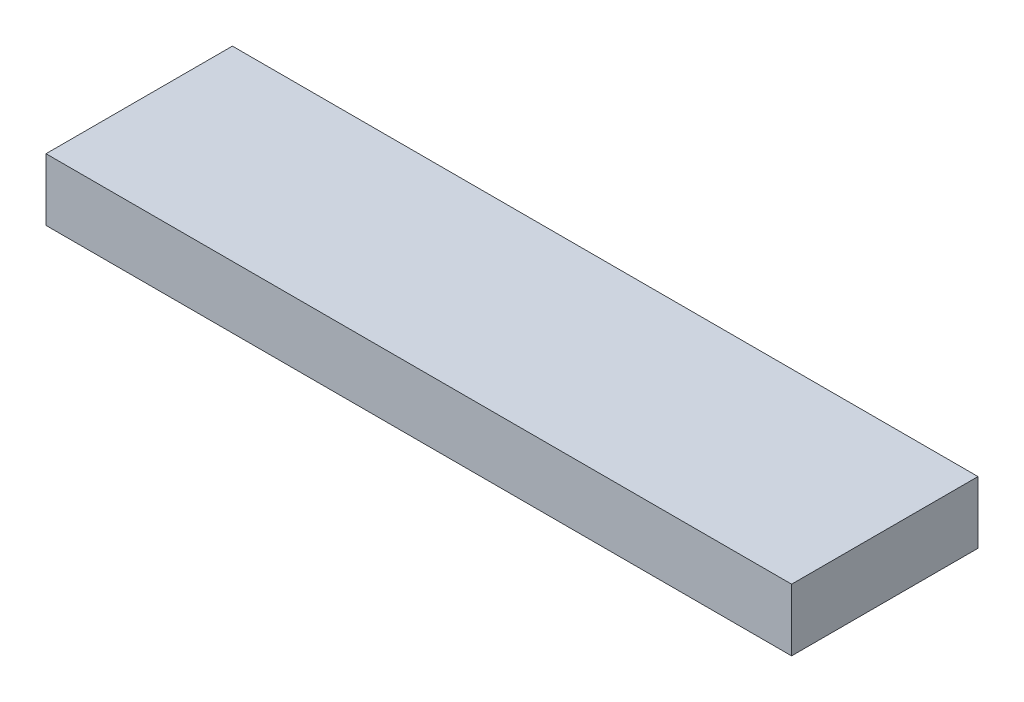
ISO-10303-21;
HEADER;
FILE_DESCRIPTION(('STEP AP214'),'2;1');
FILE_NAME('part.step','',(''),(''),'','','');
FILE_SCHEMA(('AUTOMOTIVE_DESIGN { 1 0 10303 214 1 1 1 1 }'));
ENDSEC;
DATA;
#1=APPLICATION_CONTEXT('core data for automotive mechanical design processes');
#2=APPLICATION_PROTOCOL_DEFINITION('international standard','automotive_design',2000,#1);
#3=PRODUCT_CONTEXT('',#1,'mechanical');
#4=PRODUCT('Part','Part','',(#3));
#5=PRODUCT_RELATED_PRODUCT_CATEGORY('part','',(#4));
#6=PRODUCT_DEFINITION_FORMATION('','',#4);
#7=PRODUCT_DEFINITION_CONTEXT('part definition',#1,'design');
#8=PRODUCT_DEFINITION('design','',#6,#7);
#9=PRODUCT_DEFINITION_SHAPE('','',#8);
#10=(LENGTH_UNIT() NAMED_UNIT(*) SI_UNIT(.MILLI.,.METRE.));
#11=(NAMED_UNIT(*) PLANE_ANGLE_UNIT() SI_UNIT($,.RADIAN.));
#12=(NAMED_UNIT(*) SI_UNIT($,.STERADIAN.) SOLID_ANGLE_UNIT());
#13=UNCERTAINTY_MEASURE_WITH_UNIT(LENGTH_MEASURE(1.E-05),#10,'distance_accuracy_value','');
#14=(GEOMETRIC_REPRESENTATION_CONTEXT(3) GLOBAL_UNCERTAINTY_ASSIGNED_CONTEXT((#13)) GLOBAL_UNIT_ASSIGNED_CONTEXT((#10,
#11,#12)) REPRESENTATION_CONTEXT('',''));
#15=CARTESIAN_POINT('',(0.,0.,0.));
#16=DIRECTION('',(0.,0.,1.));
#17=DIRECTION('',(1.,0.,0.));
#18=AXIS2_PLACEMENT_3D('',#15,#16,#17);
#19=CARTESIAN_POINT('',(-38.1,6.35,-9.52499999999999));
#20=DIRECTION('',(1.,0.,0.));
#21=DIRECTION('',(0.,0.,-1.));
#22=AXIS2_PLACEMENT_3D('',#19,#20,#21);
#23=PLANE('',#22);
#24=DIRECTION('',(0.,0.,1.));
#25=VECTOR('',#24,1.);
#26=CARTESIAN_POINT('',(-38.1,0.,-9.52499999999999));
#27=LINE('',#26,#25);
#28=CARTESIAN_POINT('',(-38.1,0.,-9.52499999999999));
#29=VERTEX_POINT('',#28);
#30=CARTESIAN_POINT('',(-38.1,0.,9.52500000000001));
#31=VERTEX_POINT('',#30);
#32=EDGE_CURVE('E96',#29,#31,#27,.T.);
#33=ORIENTED_EDGE('',*,*,#32,.T.);
#34=DIRECTION('',(0.,-1.,0.));
#35=VECTOR('',#34,1.);
#36=CARTESIAN_POINT('',(-38.1,6.35,9.52500000000001));
#37=LINE('',#36,#35);
#38=CARTESIAN_POINT('',(-38.1,6.35,9.52500000000001));
#39=VERTEX_POINT('',#38);
#40=EDGE_CURVE('E11',#39,#31,#37,.T.);
#41=ORIENTED_EDGE('',*,*,#40,.F.);
#42=DIRECTION('',(0.,0.,1.));
#43=VECTOR('',#42,1.);
#44=CARTESIAN_POINT('',(-38.1,6.35,-9.52499999999999));
#45=LINE('',#44,#43);
#46=CARTESIAN_POINT('',(-38.1,6.35,-9.52499999999999));
#47=VERTEX_POINT('',#46);
#48=EDGE_CURVE('E84',#47,#39,#45,.T.);
#49=ORIENTED_EDGE('',*,*,#48,.F.);
#50=DIRECTION('',(0.,-1.,0.));
#51=VECTOR('',#50,1.);
#52=CARTESIAN_POINT('',(-38.1,6.35,-9.52499999999999));
#53=LINE('',#52,#51);
#54=EDGE_CURVE('E92',#47,#29,#53,.T.);
#55=ORIENTED_EDGE('',*,*,#54,.T.);
#56=EDGE_LOOP('',(#33,#41,#49,#55));
#57=FACE_BOUND('',#56,.T.);
#58=ADVANCED_FACE('F33',(#57),#23,.F.);
#59=CARTESIAN_POINT('',(38.1,6.35,9.525));
#60=DIRECTION('',(0.,0.,-1.));
#61=DIRECTION('',(-1.,0.,0.));
#62=AXIS2_PLACEMENT_3D('',#59,#60,#61);
#63=PLANE('',#62);
#64=DIRECTION('',(1.,0.,0.));
#65=VECTOR('',#64,1.);
#66=CARTESIAN_POINT('',(38.1,0.,9.525));
#67=LINE('',#66,#65);
#68=CARTESIAN_POINT('',(38.1,0.,9.525));
#69=VERTEX_POINT('',#68);
#70=EDGE_CURVE('E88',#31,#69,#67,.T.);
#71=ORIENTED_EDGE('',*,*,#70,.T.);
#72=DIRECTION('',(0.,-1.,0.));
#73=VECTOR('',#72,1.);
#74=CARTESIAN_POINT('',(38.1,6.35,9.525));
#75=LINE('',#74,#73);
#76=CARTESIAN_POINT('',(38.1,6.35,9.525));
#77=VERTEX_POINT('',#76);
#78=EDGE_CURVE('E41',#77,#69,#75,.T.);
#79=ORIENTED_EDGE('',*,*,#78,.F.);
#80=DIRECTION('',(1.,0.,0.));
#81=VECTOR('',#80,1.);
#82=CARTESIAN_POINT('',(38.1,6.35,9.525));
#83=LINE('',#82,#81);
#84=EDGE_CURVE('E79',#39,#77,#83,.T.);
#85=ORIENTED_EDGE('',*,*,#84,.F.);
#86=ORIENTED_EDGE('',*,*,#40,.T.);
#87=EDGE_LOOP('',(#71,#79,#85,#86));
#88=FACE_BOUND('',#87,.T.);
#89=ADVANCED_FACE('F87',(#88),#63,.F.);
#90=CARTESIAN_POINT('',(38.1,6.35,-9.525));
#91=DIRECTION('',(-1.,0.,0.));
#92=DIRECTION('',(0.,0.,1.));
#93=AXIS2_PLACEMENT_3D('',#90,#91,#92);
#94=PLANE('',#93);
#95=DIRECTION('',(0.,0.,-1.));
#96=VECTOR('',#95,1.);
#97=CARTESIAN_POINT('',(38.1,0.,-9.525));
#98=LINE('',#97,#96);
#99=CARTESIAN_POINT('',(38.1,0.,-9.525));
#100=VERTEX_POINT('',#99);
#101=EDGE_CURVE('E66',#69,#100,#98,.T.);
#102=ORIENTED_EDGE('',*,*,#101,.T.);
#103=DIRECTION('',(0.,-1.,0.));
#104=VECTOR('',#103,1.);
#105=CARTESIAN_POINT('',(38.1,6.35,-9.525));
#106=LINE('',#105,#104);
#107=CARTESIAN_POINT('',(38.1,6.35,-9.525));
#108=VERTEX_POINT('',#107);
#109=EDGE_CURVE('E89',#108,#100,#106,.T.);
#110=ORIENTED_EDGE('',*,*,#109,.F.);
#111=DIRECTION('',(0.,0.,-1.));
#112=VECTOR('',#111,1.);
#113=CARTESIAN_POINT('',(38.1,6.35,-9.525));
#114=LINE('',#113,#112);
#115=EDGE_CURVE('E82',#77,#108,#114,.T.);
#116=ORIENTED_EDGE('',*,*,#115,.F.);
#117=ORIENTED_EDGE('',*,*,#78,.T.);
#118=EDGE_LOOP('',(#102,#110,#116,#117));
#119=FACE_BOUND('',#118,.T.);
#120=ADVANCED_FACE('F90',(#119),#94,.F.);
#121=CARTESIAN_POINT('',(38.1,6.35,-9.525));
#122=DIRECTION('',(0.,0.,1.));
#123=DIRECTION('',(1.,0.,0.));
#124=AXIS2_PLACEMENT_3D('',#121,#122,#123);
#125=PLANE('',#124);
#126=DIRECTION('',(-1.,0.,0.));
#127=VECTOR('',#126,1.);
#128=CARTESIAN_POINT('',(38.1,0.,-9.525));
#129=LINE('',#128,#127);
#130=EDGE_CURVE('E72',#100,#29,#129,.T.);
#131=ORIENTED_EDGE('',*,*,#130,.T.);
#132=ORIENTED_EDGE('',*,*,#54,.F.);
#133=DIRECTION('',(-1.,0.,0.));
#134=VECTOR('',#133,1.);
#135=CARTESIAN_POINT('',(38.1,6.35,-9.525));
#136=LINE('',#135,#134);
#137=EDGE_CURVE('E49',#108,#47,#136,.T.);
#138=ORIENTED_EDGE('',*,*,#137,.F.);
#139=ORIENTED_EDGE('',*,*,#109,.T.);
#140=EDGE_LOOP('',(#131,#132,#138,#139));
#141=FACE_BOUND('',#140,.T.);
#142=ADVANCED_FACE('F103',(#141),#125,.F.);
#143=CARTESIAN_POINT('',(0.,6.35,0.));
#144=DIRECTION('',(0.,-1.,0.));
#145=DIRECTION('',(0.,0.,-1.));
#146=AXIS2_PLACEMENT_3D('',#143,#144,#145);
#147=PLANE('',#146);
#148=ORIENTED_EDGE('',*,*,#48,.T.);
#149=ORIENTED_EDGE('',*,*,#84,.T.);
#150=ORIENTED_EDGE('',*,*,#115,.T.);
#151=ORIENTED_EDGE('',*,*,#137,.T.);
#152=EDGE_LOOP('',(#148,#149,#150,#151));
#153=FACE_BOUND('',#152,.T.);
#154=ADVANCED_FACE('F80',(#153),#147,.F.);
#155=CARTESIAN_POINT('',(0.,0.,0.));
#156=DIRECTION('',(0.,-1.,0.));
#157=DIRECTION('',(0.,0.,-1.));
#158=AXIS2_PLACEMENT_3D('',#155,#156,#157);
#159=PLANE('',#158);
#160=ORIENTED_EDGE('',*,*,#32,.F.);
#161=ORIENTED_EDGE('',*,*,#130,.F.);
#162=ORIENTED_EDGE('',*,*,#101,.F.);
#163=ORIENTED_EDGE('',*,*,#70,.F.);
#164=EDGE_LOOP('',(#160,#161,#162,#163));
#165=FACE_BOUND('',#164,.T.);
#166=ADVANCED_FACE('F106',(#165),#159,.T.);
#167=CLOSED_SHELL('',(#58,#89,#120,#142,#154,#166));
#168=MANIFOLD_SOLID_BREP('B2',#167);
#169=ADVANCED_BREP_SHAPE_REPRESENTATION('',(#18,#168),#14);
#170=SHAPE_DEFINITION_REPRESENTATION(#9,#169);
ENDSEC;
END-ISO-10303-21;
